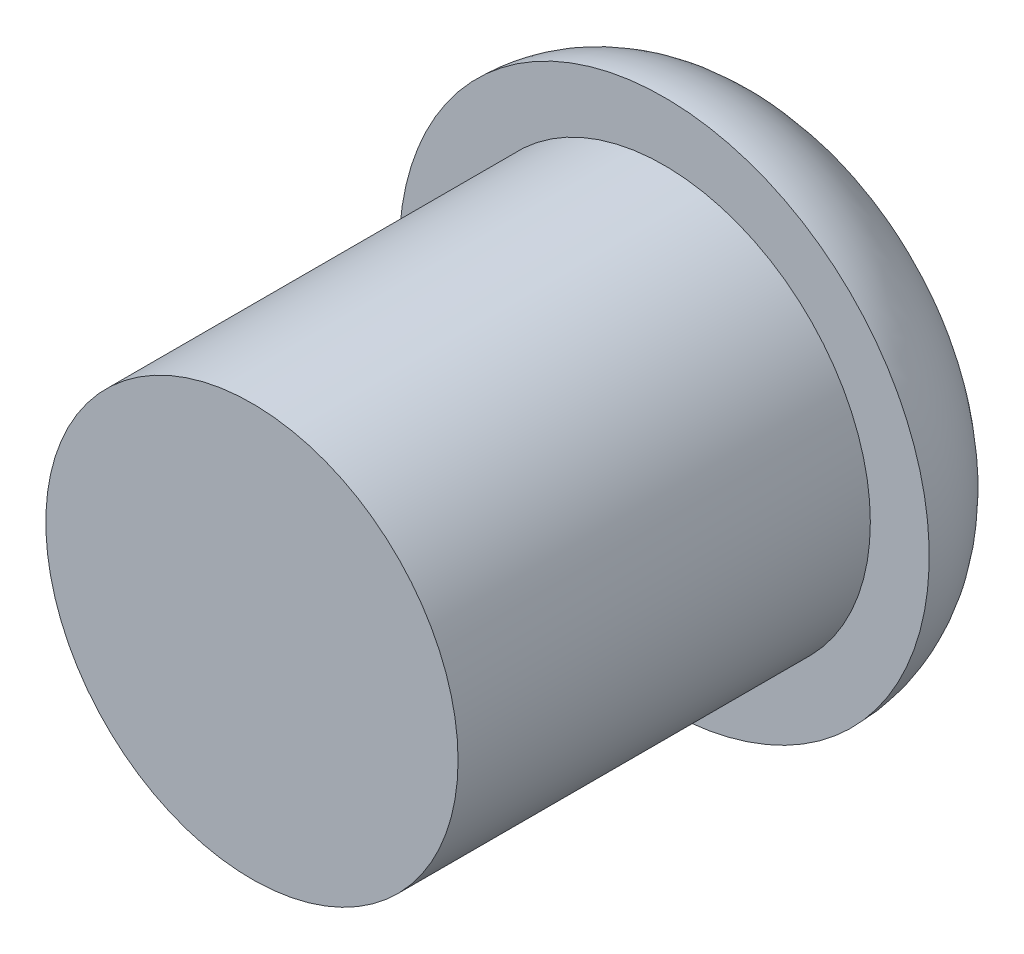
ISO-10303-21;
HEADER;
FILE_DESCRIPTION(('STEP AP214'),'2;1');
FILE_NAME('part.step','',(''),(''),'','','');
FILE_SCHEMA(('AUTOMOTIVE_DESIGN { 1 0 10303 214 1 1 1 1 }'));
ENDSEC;
DATA;
#1=APPLICATION_CONTEXT('core data for automotive mechanical design processes');
#2=APPLICATION_PROTOCOL_DEFINITION('international standard','automotive_design',2000,#1);
#3=PRODUCT_CONTEXT('',#1,'mechanical');
#4=PRODUCT('Part','Part','',(#3));
#5=PRODUCT_RELATED_PRODUCT_CATEGORY('part','',(#4));
#6=PRODUCT_DEFINITION_FORMATION('','',#4);
#7=PRODUCT_DEFINITION_CONTEXT('part definition',#1,'design');
#8=PRODUCT_DEFINITION('design','',#6,#7);
#9=PRODUCT_DEFINITION_SHAPE('','',#8);
#10=(LENGTH_UNIT() NAMED_UNIT(*) SI_UNIT(.MILLI.,.METRE.));
#11=(NAMED_UNIT(*) PLANE_ANGLE_UNIT() SI_UNIT($,.RADIAN.));
#12=(NAMED_UNIT(*) SI_UNIT($,.STERADIAN.) SOLID_ANGLE_UNIT());
#13=UNCERTAINTY_MEASURE_WITH_UNIT(LENGTH_MEASURE(1.E-05),#10,'distance_accuracy_value','');
#14=(GEOMETRIC_REPRESENTATION_CONTEXT(3) GLOBAL_UNCERTAINTY_ASSIGNED_CONTEXT((#13)) GLOBAL_UNIT_ASSIGNED_CONTEXT((#10,
#11,#12)) REPRESENTATION_CONTEXT('',''));
#15=CARTESIAN_POINT('',(0.,0.,0.));
#16=DIRECTION('',(0.,0.,1.));
#17=DIRECTION('',(1.,0.,0.));
#18=AXIS2_PLACEMENT_3D('',#15,#16,#17);
#19=CARTESIAN_POINT('',(0.,0.,7.));
#20=DIRECTION('',(0.,0.,-1.));
#21=DIRECTION('',(-1.,0.,0.));
#22=AXIS2_PLACEMENT_3D('',#19,#20,#21);
#23=CYLINDRICAL_SURFACE('',#22,3.5);
#24=CARTESIAN_POINT('',(0.,0.,7.));
#25=DIRECTION('',(0.,0.,1.));
#26=DIRECTION('',(1.,0.,0.));
#27=AXIS2_PLACEMENT_3D('',#24,#25,#26);
#28=CIRCLE('',#27,3.5);
#29=CARTESIAN_POINT('',(3.5,0.,7.));
#30=VERTEX_POINT('',#29);
#31=EDGE_CURVE('E42',#30,#30,#28,.T.);
#32=ORIENTED_EDGE('',*,*,#31,.F.);
#33=EDGE_LOOP('',(#32));
#34=FACE_BOUND('',#33,.T.);
#35=CARTESIAN_POINT('',(0.,0.,0.));
#36=DIRECTION('',(0.,0.,1.));
#37=DIRECTION('',(1.,0.,0.));
#38=AXIS2_PLACEMENT_3D('',#35,#36,#37);
#39=CIRCLE('',#38,3.5);
#40=CARTESIAN_POINT('',(3.5,0.,0.));
#41=VERTEX_POINT('',#40);
#42=EDGE_CURVE('E46',#41,#41,#39,.T.);
#43=ORIENTED_EDGE('',*,*,#42,.T.);
#44=EDGE_LOOP('',(#43));
#45=FACE_BOUND('',#44,.T.);
#46=ADVANCED_FACE('F35',(#34,#45),#23,.T.);
#47=CARTESIAN_POINT('',(0.,0.,7.));
#48=DIRECTION('',(0.,0.,1.));
#49=DIRECTION('',(1.,0.,0.));
#50=AXIS2_PLACEMENT_3D('',#47,#48,#49);
#51=PLANE('',#50);
#52=ORIENTED_EDGE('',*,*,#31,.T.);
#53=EDGE_LOOP('',(#52));
#54=FACE_BOUND('',#53,.T.);
#55=ADVANCED_FACE('F67',(#54),#51,.T.);
#56=CARTESIAN_POINT('',(0.,0.,-2.));
#57=DIRECTION('',(0.,0.,-1.));
#58=DIRECTION('',(-1.,0.,0.));
#59=AXIS2_PLACEMENT_3D('',#56,#57,#58);
#60=PLANE('',#59);
#61=CARTESIAN_POINT('',(0.,0.,-2.));
#62=DIRECTION('',(0.,0.,-1.));
#63=DIRECTION('',(-1.,0.,0.));
#64=AXIS2_PLACEMENT_3D('',#61,#62,#63);
#65=CIRCLE('',#64,2.5);
#66=CARTESIAN_POINT('',(-2.5,0.,-2.));
#67=VERTEX_POINT('',#66);
#68=EDGE_CURVE('E10',#67,#67,#65,.T.);
#69=ORIENTED_EDGE('',*,*,#68,.T.);
#70=EDGE_LOOP('',(#69));
#71=FACE_BOUND('',#70,.T.);
#72=ADVANCED_FACE('F60',(#71),#60,.T.);
#73=CARTESIAN_POINT('',(0.,0.,0.));
#74=DIRECTION('',(0.,0.,-1.));
#75=DIRECTION('',(-1.,0.,0.));
#76=AXIS2_PLACEMENT_3D('',#73,#74,#75);
#77=PLANE('',#76);
#78=ORIENTED_EDGE('',*,*,#42,.F.);
#79=EDGE_LOOP('',(#78));
#80=FACE_BOUND('',#79,.T.);
#81=CARTESIAN_POINT('',(0.,0.,0.));
#82=DIRECTION('',(0.,0.,-1.));
#83=DIRECTION('',(-1.,0.,0.));
#84=AXIS2_PLACEMENT_3D('',#81,#82,#83);
#85=CIRCLE('',#84,4.5);
#86=CARTESIAN_POINT('',(-4.5,0.,0.));
#87=VERTEX_POINT('',#86);
#88=EDGE_CURVE('E51',#87,#87,#85,.T.);
#89=ORIENTED_EDGE('',*,*,#88,.F.);
#90=EDGE_LOOP('',(#89));
#91=FACE_BOUND('',#90,.T.);
#92=ADVANCED_FACE('F58',(#80,#91),#77,.F.);
#93=CARTESIAN_POINT('',(0.,0.,0.));
#94=DIRECTION('',(0.,0.,-1.));
#95=DIRECTION('',(-1.,0.,0.));
#96=AXIS2_PLACEMENT_3D('',#93,#94,#95);
#97=TOROIDAL_SURFACE('',#96,2.5,2.);
#98=ORIENTED_EDGE('',*,*,#88,.T.);
#99=EDGE_LOOP('',(#98));
#100=FACE_BOUND('',#99,.T.);
#101=ORIENTED_EDGE('',*,*,#68,.F.);
#102=EDGE_LOOP('',(#101));
#103=FACE_BOUND('',#102,.T.);
#104=ADVANCED_FACE('F37',(#100,#103),#97,.T.);
#105=CLOSED_SHELL('',(#46,#55,#72,#92,#104));
#106=MANIFOLD_SOLID_BREP('B2',#105);
#107=ADVANCED_BREP_SHAPE_REPRESENTATION('',(#18,#106),#14);
#108=SHAPE_DEFINITION_REPRESENTATION(#9,#107);
ENDSEC;
END-ISO-10303-21;
